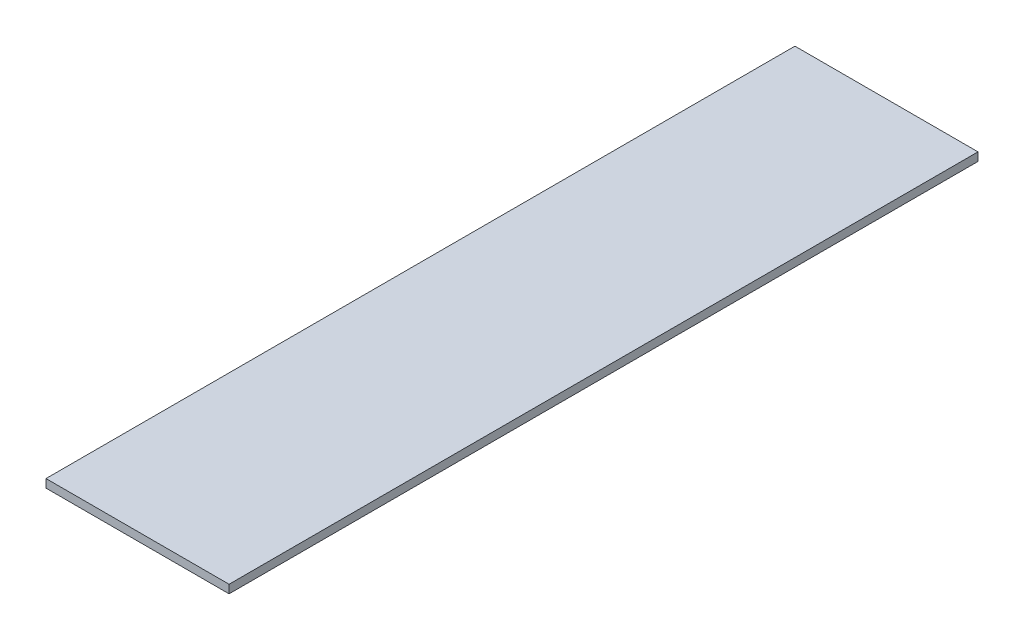
ISO-10303-21;
HEADER;
FILE_DESCRIPTION(('STEP AP214'),'2;1');
FILE_NAME('part.step','',(''),(''),'','','');
FILE_SCHEMA(('AUTOMOTIVE_DESIGN { 1 0 10303 214 1 1 1 1 }'));
ENDSEC;
DATA;
#1=APPLICATION_CONTEXT('core data for automotive mechanical design processes');
#2=APPLICATION_PROTOCOL_DEFINITION('international standard','automotive_design',2000,#1);
#3=PRODUCT_CONTEXT('',#1,'mechanical');
#4=PRODUCT('Part','Part','',(#3));
#5=PRODUCT_RELATED_PRODUCT_CATEGORY('part','',(#4));
#6=PRODUCT_DEFINITION_FORMATION('','',#4);
#7=PRODUCT_DEFINITION_CONTEXT('part definition',#1,'design');
#8=PRODUCT_DEFINITION('design','',#6,#7);
#9=PRODUCT_DEFINITION_SHAPE('','',#8);
#10=(LENGTH_UNIT() NAMED_UNIT(*) SI_UNIT(.MILLI.,.METRE.));
#11=(NAMED_UNIT(*) PLANE_ANGLE_UNIT() SI_UNIT($,.RADIAN.));
#12=(NAMED_UNIT(*) SI_UNIT($,.STERADIAN.) SOLID_ANGLE_UNIT());
#13=UNCERTAINTY_MEASURE_WITH_UNIT(LENGTH_MEASURE(1.E-05),#10,'distance_accuracy_value','');
#14=(GEOMETRIC_REPRESENTATION_CONTEXT(3) GLOBAL_UNCERTAINTY_ASSIGNED_CONTEXT((#13)) GLOBAL_UNIT_ASSIGNED_CONTEXT((#10,
#11,#12)) REPRESENTATION_CONTEXT('',''));
#15=CARTESIAN_POINT('',(0.,0.,0.));
#16=DIRECTION('',(0.,0.,1.));
#17=DIRECTION('',(1.,0.,0.));
#18=AXIS2_PLACEMENT_3D('',#15,#16,#17);
#19=CARTESIAN_POINT('',(0.,-6.35,225.592105263158));
#20=DIRECTION('',(0.,0.,1.));
#21=DIRECTION('',(1.,0.,0.));
#22=AXIS2_PLACEMENT_3D('',#19,#20,#21);
#23=PLANE('',#22);
#24=DIRECTION('',(1.,0.,0.));
#25=VECTOR('',#24,1.);
#26=CARTESIAN_POINT('',(0.,0.,225.592105263158));
#27=LINE('',#26,#25);
#28=CARTESIAN_POINT('',(-139.7,0.,225.592105263158));
#29=VERTEX_POINT('',#28);
#30=CARTESIAN_POINT('',(0.,0.,225.592105263158));
#31=VERTEX_POINT('',#30);
#32=EDGE_CURVE('E103',#29,#31,#27,.T.);
#33=ORIENTED_EDGE('',*,*,#32,.F.);
#34=DIRECTION('',(0.,1.,0.));
#35=VECTOR('',#34,1.);
#36=CARTESIAN_POINT('',(-139.7,-6.35,225.592105263158));
#37=LINE('',#36,#35);
#38=CARTESIAN_POINT('',(-139.7,-6.35,225.592105263158));
#39=VERTEX_POINT('',#38);
#40=EDGE_CURVE('E11',#39,#29,#37,.T.);
#41=ORIENTED_EDGE('',*,*,#40,.F.);
#42=DIRECTION('',(1.,0.,0.));
#43=VECTOR('',#42,1.);
#44=CARTESIAN_POINT('',(0.,-6.35,225.592105263158));
#45=LINE('',#44,#43);
#46=CARTESIAN_POINT('',(0.,-6.35,225.592105263158));
#47=VERTEX_POINT('',#46);
#48=EDGE_CURVE('E97',#39,#47,#45,.T.);
#49=ORIENTED_EDGE('',*,*,#48,.T.);
#50=DIRECTION('',(0.,1.,0.));
#51=VECTOR('',#50,1.);
#52=CARTESIAN_POINT('',(0.,-6.35,225.592105263158));
#53=LINE('',#52,#51);
#54=EDGE_CURVE('E42',#47,#31,#53,.T.);
#55=ORIENTED_EDGE('',*,*,#54,.T.);
#56=EDGE_LOOP('',(#33,#41,#49,#55));
#57=FACE_BOUND('',#56,.T.);
#58=ADVANCED_FACE('F39',(#57),#23,.T.);
#59=CARTESIAN_POINT('',(-139.7,-6.35,225.592105263158));
#60=DIRECTION('',(-1.,0.,0.));
#61=DIRECTION('',(0.,0.,1.));
#62=AXIS2_PLACEMENT_3D('',#59,#60,#61);
#63=PLANE('',#62);
#64=DIRECTION('',(0.,0.,1.));
#65=VECTOR('',#64,1.);
#66=CARTESIAN_POINT('',(-139.7,0.,225.592105263158));
#67=LINE('',#66,#65);
#68=CARTESIAN_POINT('',(-139.7,0.,-345.907894736842));
#69=VERTEX_POINT('',#68);
#70=EDGE_CURVE('E99',#69,#29,#67,.T.);
#71=ORIENTED_EDGE('',*,*,#70,.F.);
#72=DIRECTION('',(0.,1.,0.));
#73=VECTOR('',#72,1.);
#74=CARTESIAN_POINT('',(-139.7,-6.35,-345.907894736842));
#75=LINE('',#74,#73);
#76=CARTESIAN_POINT('',(-139.7,-6.35,-345.907894736842));
#77=VERTEX_POINT('',#76);
#78=EDGE_CURVE('E48',#77,#69,#75,.T.);
#79=ORIENTED_EDGE('',*,*,#78,.F.);
#80=DIRECTION('',(0.,0.,1.));
#81=VECTOR('',#80,1.);
#82=CARTESIAN_POINT('',(-139.7,-6.35,225.592105263158));
#83=LINE('',#82,#81);
#84=EDGE_CURVE('E94',#77,#39,#83,.T.);
#85=ORIENTED_EDGE('',*,*,#84,.T.);
#86=ORIENTED_EDGE('',*,*,#40,.T.);
#87=EDGE_LOOP('',(#71,#79,#85,#86));
#88=FACE_BOUND('',#87,.T.);
#89=ADVANCED_FACE('F113',(#88),#63,.T.);
#90=CARTESIAN_POINT('',(0.,-6.35,-345.907894736842));
#91=DIRECTION('',(0.,0.,-1.));
#92=DIRECTION('',(-1.,0.,0.));
#93=AXIS2_PLACEMENT_3D('',#90,#91,#92);
#94=PLANE('',#93);
#95=DIRECTION('',(-1.,0.,0.));
#96=VECTOR('',#95,1.);
#97=CARTESIAN_POINT('',(0.,0.,-345.907894736842));
#98=LINE('',#97,#96);
#99=CARTESIAN_POINT('',(0.,0.,-345.907894736842));
#100=VERTEX_POINT('',#99);
#101=EDGE_CURVE('E89',#100,#69,#98,.T.);
#102=ORIENTED_EDGE('',*,*,#101,.F.);
#103=DIRECTION('',(0.,1.,0.));
#104=VECTOR('',#103,1.);
#105=CARTESIAN_POINT('',(0.,-6.35,-345.907894736842));
#106=LINE('',#105,#104);
#107=CARTESIAN_POINT('',(0.,-6.35,-345.907894736842));
#108=VERTEX_POINT('',#107);
#109=EDGE_CURVE('E84',#108,#100,#106,.T.);
#110=ORIENTED_EDGE('',*,*,#109,.F.);
#111=DIRECTION('',(-1.,0.,0.));
#112=VECTOR('',#111,1.);
#113=CARTESIAN_POINT('',(0.,-6.35,-345.907894736842));
#114=LINE('',#113,#112);
#115=EDGE_CURVE('E87',#108,#77,#114,.T.);
#116=ORIENTED_EDGE('',*,*,#115,.T.);
#117=ORIENTED_EDGE('',*,*,#78,.T.);
#118=EDGE_LOOP('',(#102,#110,#116,#117));
#119=FACE_BOUND('',#118,.T.);
#120=ADVANCED_FACE('F86',(#119),#94,.T.);
#121=CARTESIAN_POINT('',(0.,-6.35,225.592105263158));
#122=DIRECTION('',(1.,0.,0.));
#123=DIRECTION('',(0.,0.,-1.));
#124=AXIS2_PLACEMENT_3D('',#121,#122,#123);
#125=PLANE('',#124);
#126=DIRECTION('',(0.,0.,-1.));
#127=VECTOR('',#126,1.);
#128=CARTESIAN_POINT('',(0.,0.,225.592105263158));
#129=LINE('',#128,#127);
#130=EDGE_CURVE('E106',#31,#100,#129,.T.);
#131=ORIENTED_EDGE('',*,*,#130,.F.);
#132=ORIENTED_EDGE('',*,*,#54,.F.);
#133=DIRECTION('',(0.,0.,-1.));
#134=VECTOR('',#133,1.);
#135=CARTESIAN_POINT('',(0.,-6.35,225.592105263158));
#136=LINE('',#135,#134);
#137=EDGE_CURVE('E93',#47,#108,#136,.T.);
#138=ORIENTED_EDGE('',*,*,#137,.T.);
#139=ORIENTED_EDGE('',*,*,#109,.T.);
#140=EDGE_LOOP('',(#131,#132,#138,#139));
#141=FACE_BOUND('',#140,.T.);
#142=ADVANCED_FACE('F96',(#141),#125,.T.);
#143=CARTESIAN_POINT('',(0.,-6.35,0.));
#144=DIRECTION('',(0.,-1.,0.));
#145=DIRECTION('',(0.,0.,-1.));
#146=AXIS2_PLACEMENT_3D('',#143,#144,#145);
#147=PLANE('',#146);
#148=ORIENTED_EDGE('',*,*,#48,.F.);
#149=ORIENTED_EDGE('',*,*,#84,.F.);
#150=ORIENTED_EDGE('',*,*,#115,.F.);
#151=ORIENTED_EDGE('',*,*,#137,.F.);
#152=EDGE_LOOP('',(#148,#149,#150,#151));
#153=FACE_BOUND('',#152,.T.);
#154=ADVANCED_FACE('F92',(#153),#147,.T.);
#155=CARTESIAN_POINT('',(0.,0.,0.));
#156=DIRECTION('',(0.,-1.,0.));
#157=DIRECTION('',(0.,0.,-1.));
#158=AXIS2_PLACEMENT_3D('',#155,#156,#157);
#159=PLANE('',#158);
#160=ORIENTED_EDGE('',*,*,#32,.T.);
#161=ORIENTED_EDGE('',*,*,#130,.T.);
#162=ORIENTED_EDGE('',*,*,#101,.T.);
#163=ORIENTED_EDGE('',*,*,#70,.T.);
#164=EDGE_LOOP('',(#160,#161,#162,#163));
#165=FACE_BOUND('',#164,.T.);
#166=ADVANCED_FACE('F112',(#165),#159,.F.);
#167=CLOSED_SHELL('',(#58,#89,#120,#142,#154,#166));
#168=MANIFOLD_SOLID_BREP('B2',#167);
#169=ADVANCED_BREP_SHAPE_REPRESENTATION('',(#18,#168),#14);
#170=SHAPE_DEFINITION_REPRESENTATION(#9,#169);
ENDSEC;
END-ISO-10303-21;
